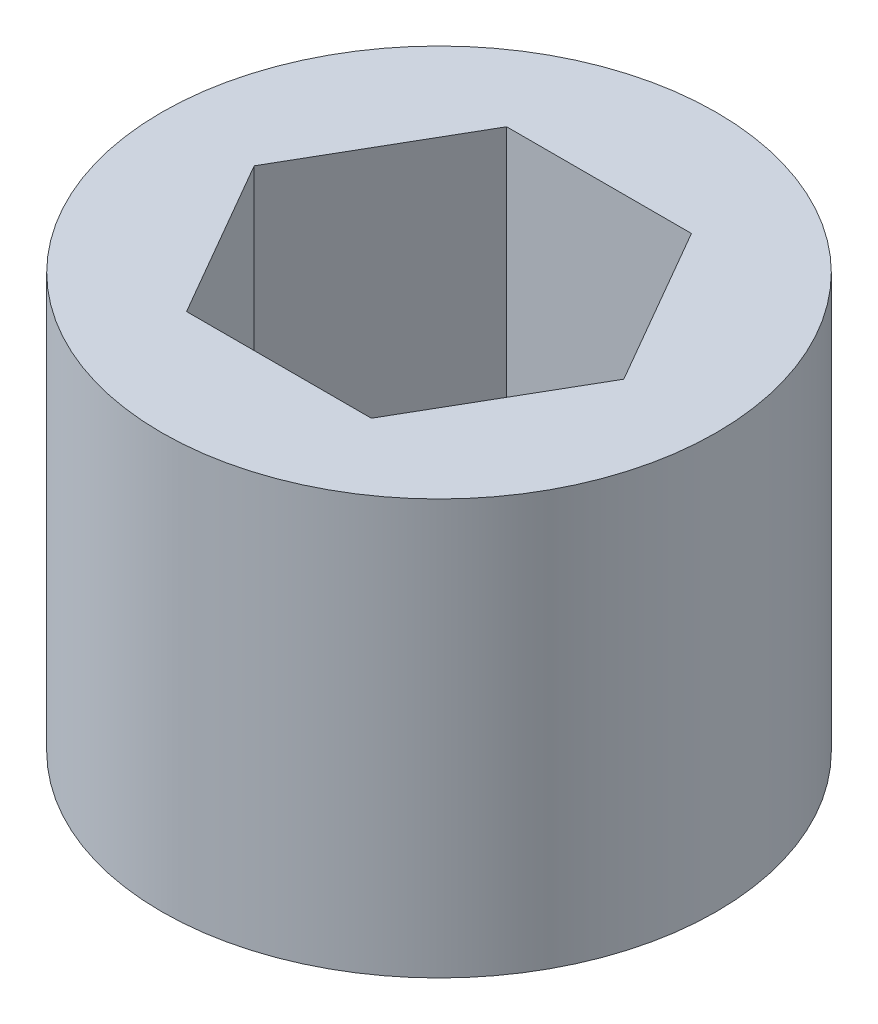
ISO-10303-21;
HEADER;
FILE_DESCRIPTION(('STEP AP214'),'2;1');
FILE_NAME('part.step','',(''),(''),'','','');
FILE_SCHEMA(('AUTOMOTIVE_DESIGN { 1 0 10303 214 1 1 1 1 }'));
ENDSEC;
DATA;
#1=APPLICATION_CONTEXT('core data for automotive mechanical design processes');
#2=APPLICATION_PROTOCOL_DEFINITION('international standard','automotive_design',2000,#1);
#3=PRODUCT_CONTEXT('',#1,'mechanical');
#4=PRODUCT('Part','Part','',(#3));
#5=PRODUCT_RELATED_PRODUCT_CATEGORY('part','',(#4));
#6=PRODUCT_DEFINITION_FORMATION('','',#4);
#7=PRODUCT_DEFINITION_CONTEXT('part definition',#1,'design');
#8=PRODUCT_DEFINITION('design','',#6,#7);
#9=PRODUCT_DEFINITION_SHAPE('','',#8);
#10=(LENGTH_UNIT() NAMED_UNIT(*) SI_UNIT(.MILLI.,.METRE.));
#11=(NAMED_UNIT(*) PLANE_ANGLE_UNIT() SI_UNIT($,.RADIAN.));
#12=(NAMED_UNIT(*) SI_UNIT($,.STERADIAN.) SOLID_ANGLE_UNIT());
#13=UNCERTAINTY_MEASURE_WITH_UNIT(LENGTH_MEASURE(1.E-05),#10,'distance_accuracy_value','');
#14=(GEOMETRIC_REPRESENTATION_CONTEXT(3) GLOBAL_UNCERTAINTY_ASSIGNED_CONTEXT((#13)) GLOBAL_UNIT_ASSIGNED_CONTEXT((#10,
#11,#12)) REPRESENTATION_CONTEXT('',''));
#15=CARTESIAN_POINT('',(0.,0.,0.));
#16=DIRECTION('',(0.,0.,1.));
#17=DIRECTION('',(1.,0.,0.));
#18=AXIS2_PLACEMENT_3D('',#15,#16,#17);
#19=CARTESIAN_POINT('',(0.,3.0861,0.));
#20=DIRECTION('',(0.,1.,0.));
#21=DIRECTION('',(0.,0.,1.));
#22=AXIS2_PLACEMENT_3D('',#19,#20,#21);
#23=PLANE('',#22);
#24=CARTESIAN_POINT('',(0.,3.0861,0.));
#25=DIRECTION('',(0.,1.,0.));
#26=DIRECTION('',(0.,0.,1.));
#27=AXIS2_PLACEMENT_3D('',#24,#25,#26);
#28=CIRCLE('',#27,4.1275);
#29=CARTESIAN_POINT('',(0.,3.0861,4.1275));
#30=VERTEX_POINT('',#29);
#31=EDGE_CURVE('E11',#30,#30,#28,.T.);
#32=ORIENTED_EDGE('',*,*,#31,.T.);
#33=EDGE_LOOP('',(#32));
#34=FACE_BOUND('',#33,.T.);
#35=DIRECTION('',(0.5,0.,-0.866025403784439));
#36=VECTOR('',#35,1.);
#37=CARTESIAN_POINT('',(1.3748153285078,3.0861,2.38125));
#38=LINE('',#37,#36);
#39=CARTESIAN_POINT('',(1.3748153285078,3.0861,2.38125));
#40=VERTEX_POINT('',#39);
#41=CARTESIAN_POINT('',(2.74963065701559,3.0861,0.));
#42=VERTEX_POINT('',#41);
#43=EDGE_CURVE('E102',#40,#42,#38,.T.);
#44=ORIENTED_EDGE('',*,*,#43,.F.);
#45=DIRECTION('',(1.,0.,0.));
#46=VECTOR('',#45,1.);
#47=CARTESIAN_POINT('',(-1.3748153285078,3.0861,2.38125));
#48=LINE('',#47,#46);
#49=CARTESIAN_POINT('',(-1.3748153285078,3.0861,2.38125));
#50=VERTEX_POINT('',#49);
#51=EDGE_CURVE('E93',#50,#40,#48,.T.);
#52=ORIENTED_EDGE('',*,*,#51,.F.);
#53=DIRECTION('',(0.5,0.,0.866025403784439));
#54=VECTOR('',#53,1.);
#55=CARTESIAN_POINT('',(-2.74963065701559,3.0861,0.));
#56=LINE('',#55,#54);
#57=CARTESIAN_POINT('',(-2.74963065701559,3.0861,0.));
#58=VERTEX_POINT('',#57);
#59=EDGE_CURVE('E127',#58,#50,#56,.T.);
#60=ORIENTED_EDGE('',*,*,#59,.F.);
#61=DIRECTION('',(-0.5,0.,0.866025403784439));
#62=VECTOR('',#61,1.);
#63=CARTESIAN_POINT('',(-1.3748153285078,3.0861,-2.38125));
#64=LINE('',#63,#62);
#65=CARTESIAN_POINT('',(-1.3748153285078,3.0861,-2.38125));
#66=VERTEX_POINT('',#65);
#67=EDGE_CURVE('E124',#66,#58,#64,.T.);
#68=ORIENTED_EDGE('',*,*,#67,.F.);
#69=DIRECTION('',(-1.,0.,0.));
#70=VECTOR('',#69,1.);
#71=CARTESIAN_POINT('',(1.3748153285078,3.0861,-2.38125));
#72=LINE('',#71,#70);
#73=CARTESIAN_POINT('',(1.3748153285078,3.0861,-2.38125));
#74=VERTEX_POINT('',#73);
#75=EDGE_CURVE('E119',#74,#66,#72,.T.);
#76=ORIENTED_EDGE('',*,*,#75,.F.);
#77=DIRECTION('',(-0.5,0.,-0.866025403784438));
#78=VECTOR('',#77,1.);
#79=CARTESIAN_POINT('',(2.74963065701559,3.0861,0.));
#80=LINE('',#79,#78);
#81=EDGE_CURVE('E115',#42,#74,#80,.T.);
#82=ORIENTED_EDGE('',*,*,#81,.F.);
#83=EDGE_LOOP('',(#44,#52,#60,#68,#76,#82));
#84=FACE_BOUND('',#83,.T.);
#85=ADVANCED_FACE('F39',(#34,#84),#23,.T.);
#86=CARTESIAN_POINT('',(0.,-3.0861,0.));
#87=DIRECTION('',(0.,1.,0.));
#88=DIRECTION('',(0.,0.,1.));
#89=AXIS2_PLACEMENT_3D('',#86,#87,#88);
#90=PLANE('',#89);
#91=CARTESIAN_POINT('',(0.,-3.0861,0.));
#92=DIRECTION('',(0.,1.,0.));
#93=DIRECTION('',(0.,0.,1.));
#94=AXIS2_PLACEMENT_3D('',#91,#92,#93);
#95=CIRCLE('',#94,4.1275);
#96=CARTESIAN_POINT('',(0.,-3.0861,4.1275));
#97=VERTEX_POINT('',#96);
#98=EDGE_CURVE('E43',#97,#97,#95,.T.);
#99=ORIENTED_EDGE('',*,*,#98,.F.);
#100=EDGE_LOOP('',(#99));
#101=FACE_BOUND('',#100,.T.);
#102=DIRECTION('',(1.,0.,0.));
#103=VECTOR('',#102,1.);
#104=CARTESIAN_POINT('',(-1.3748153285078,-3.0861,2.38125));
#105=LINE('',#104,#103);
#106=CARTESIAN_POINT('',(-1.3748153285078,-3.0861,2.38125));
#107=VERTEX_POINT('',#106);
#108=CARTESIAN_POINT('',(1.3748153285078,-3.0861,2.38125));
#109=VERTEX_POINT('',#108);
#110=EDGE_CURVE('E63',#107,#109,#105,.T.);
#111=ORIENTED_EDGE('',*,*,#110,.T.);
#112=DIRECTION('',(0.5,0.,-0.866025403784439));
#113=VECTOR('',#112,1.);
#114=CARTESIAN_POINT('',(1.3748153285078,-3.0861,2.38125));
#115=LINE('',#114,#113);
#116=CARTESIAN_POINT('',(2.74963065701559,-3.0861,0.));
#117=VERTEX_POINT('',#116);
#118=EDGE_CURVE('E109',#109,#117,#115,.T.);
#119=ORIENTED_EDGE('',*,*,#118,.T.);
#120=DIRECTION('',(-0.5,0.,-0.866025403784438));
#121=VECTOR('',#120,1.);
#122=CARTESIAN_POINT('',(2.74963065701559,-3.0861,0.));
#123=LINE('',#122,#121);
#124=CARTESIAN_POINT('',(1.3748153285078,-3.0861,-2.38125));
#125=VERTEX_POINT('',#124);
#126=EDGE_CURVE('E134',#117,#125,#123,.T.);
#127=ORIENTED_EDGE('',*,*,#126,.T.);
#128=DIRECTION('',(-1.,0.,0.));
#129=VECTOR('',#128,1.);
#130=CARTESIAN_POINT('',(1.3748153285078,-3.0861,-2.38125));
#131=LINE('',#130,#129);
#132=CARTESIAN_POINT('',(-1.3748153285078,-3.0861,-2.38125));
#133=VERTEX_POINT('',#132);
#134=EDGE_CURVE('E138',#125,#133,#131,.T.);
#135=ORIENTED_EDGE('',*,*,#134,.T.);
#136=DIRECTION('',(-0.5,0.,0.866025403784439));
#137=VECTOR('',#136,1.);
#138=CARTESIAN_POINT('',(-1.3748153285078,-3.0861,-2.38125));
#139=LINE('',#138,#137);
#140=CARTESIAN_POINT('',(-2.74963065701559,-3.0861,0.));
#141=VERTEX_POINT('',#140);
#142=EDGE_CURVE('E142',#133,#141,#139,.T.);
#143=ORIENTED_EDGE('',*,*,#142,.T.);
#144=DIRECTION('',(0.5,0.,0.866025403784439));
#145=VECTOR('',#144,1.);
#146=CARTESIAN_POINT('',(-2.74963065701559,-3.0861,0.));
#147=LINE('',#146,#145);
#148=EDGE_CURVE('E103',#141,#107,#147,.T.);
#149=ORIENTED_EDGE('',*,*,#148,.T.);
#150=EDGE_LOOP('',(#111,#119,#127,#135,#143,#149));
#151=FACE_BOUND('',#150,.T.);
#152=ADVANCED_FACE('F166',(#101,#151),#90,.F.);
#153=CARTESIAN_POINT('',(0.,3.0861,0.));
#154=DIRECTION('',(0.,-1.,0.));
#155=DIRECTION('',(0.,0.,-1.));
#156=AXIS2_PLACEMENT_3D('',#153,#154,#155);
#157=CYLINDRICAL_SURFACE('',#156,4.1275);
#158=ORIENTED_EDGE('',*,*,#31,.F.);
#159=EDGE_LOOP('',(#158));
#160=FACE_BOUND('',#159,.T.);
#161=ORIENTED_EDGE('',*,*,#98,.T.);
#162=EDGE_LOOP('',(#161));
#163=FACE_BOUND('',#162,.T.);
#164=ADVANCED_FACE('F41',(#160,#163),#157,.T.);
#165=CARTESIAN_POINT('',(-1.3748153285078,3.0861,2.38125));
#166=DIRECTION('',(0.,0.,-1.));
#167=DIRECTION('',(-1.,0.,0.));
#168=AXIS2_PLACEMENT_3D('',#165,#166,#167);
#169=PLANE('',#168);
#170=ORIENTED_EDGE('',*,*,#110,.F.);
#171=DIRECTION('',(0.,-1.,0.));
#172=VECTOR('',#171,1.);
#173=CARTESIAN_POINT('',(-1.3748153285078,3.0861,2.38125));
#174=LINE('',#173,#172);
#175=EDGE_CURVE('E97',#50,#107,#174,.T.);
#176=ORIENTED_EDGE('',*,*,#175,.F.);
#177=ORIENTED_EDGE('',*,*,#51,.T.);
#178=DIRECTION('',(0.,-1.,0.));
#179=VECTOR('',#178,1.);
#180=CARTESIAN_POINT('',(1.3748153285078,3.0861,2.38125));
#181=LINE('',#180,#179);
#182=EDGE_CURVE('E96',#40,#109,#181,.T.);
#183=ORIENTED_EDGE('',*,*,#182,.T.);
#184=EDGE_LOOP('',(#170,#176,#177,#183));
#185=FACE_BOUND('',#184,.T.);
#186=ADVANCED_FACE('F95',(#185),#169,.T.);
#187=CARTESIAN_POINT('',(1.3748153285078,3.0861,2.38125));
#188=DIRECTION('',(-0.866025403784439,0.,-0.5));
#189=DIRECTION('',(-0.5,0.,0.866025403784439));
#190=AXIS2_PLACEMENT_3D('',#187,#188,#189);
#191=PLANE('',#190);
#192=ORIENTED_EDGE('',*,*,#118,.F.);
#193=ORIENTED_EDGE('',*,*,#182,.F.);
#194=ORIENTED_EDGE('',*,*,#43,.T.);
#195=DIRECTION('',(0.,-1.,0.));
#196=VECTOR('',#195,1.);
#197=CARTESIAN_POINT('',(2.74963065701559,3.0861,0.));
#198=LINE('',#197,#196);
#199=EDGE_CURVE('E111',#42,#117,#198,.T.);
#200=ORIENTED_EDGE('',*,*,#199,.T.);
#201=EDGE_LOOP('',(#192,#193,#194,#200));
#202=FACE_BOUND('',#201,.T.);
#203=ADVANCED_FACE('F106',(#202),#191,.T.);
#204=CARTESIAN_POINT('',(2.74963065701559,3.0861,0.));
#205=DIRECTION('',(-0.866025403784438,0.,0.5));
#206=DIRECTION('',(0.5,0.,0.866025403784438));
#207=AXIS2_PLACEMENT_3D('',#204,#205,#206);
#208=PLANE('',#207);
#209=ORIENTED_EDGE('',*,*,#126,.F.);
#210=ORIENTED_EDGE('',*,*,#199,.F.);
#211=ORIENTED_EDGE('',*,*,#81,.T.);
#212=DIRECTION('',(0.,-1.,0.));
#213=VECTOR('',#212,1.);
#214=CARTESIAN_POINT('',(1.3748153285078,3.0861,-2.38125));
#215=LINE('',#214,#213);
#216=EDGE_CURVE('E156',#74,#125,#215,.T.);
#217=ORIENTED_EDGE('',*,*,#216,.T.);
#218=EDGE_LOOP('',(#209,#210,#211,#217));
#219=FACE_BOUND('',#218,.T.);
#220=ADVANCED_FACE('F162',(#219),#208,.T.);
#221=CARTESIAN_POINT('',(1.3748153285078,3.0861,-2.38125));
#222=DIRECTION('',(0.,0.,1.));
#223=DIRECTION('',(1.,0.,0.));
#224=AXIS2_PLACEMENT_3D('',#221,#222,#223);
#225=PLANE('',#224);
#226=ORIENTED_EDGE('',*,*,#134,.F.);
#227=ORIENTED_EDGE('',*,*,#216,.F.);
#228=ORIENTED_EDGE('',*,*,#75,.T.);
#229=DIRECTION('',(0.,-1.,0.));
#230=VECTOR('',#229,1.);
#231=CARTESIAN_POINT('',(-1.3748153285078,3.0861,-2.38125));
#232=LINE('',#231,#230);
#233=EDGE_CURVE('E153',#66,#133,#232,.T.);
#234=ORIENTED_EDGE('',*,*,#233,.T.);
#235=EDGE_LOOP('',(#226,#227,#228,#234));
#236=FACE_BOUND('',#235,.T.);
#237=ADVANCED_FACE('F174',(#236),#225,.T.);
#238=CARTESIAN_POINT('',(-1.3748153285078,3.0861,-2.38125));
#239=DIRECTION('',(0.866025403784439,0.,0.5));
#240=DIRECTION('',(0.5,0.,-0.866025403784439));
#241=AXIS2_PLACEMENT_3D('',#238,#239,#240);
#242=PLANE('',#241);
#243=ORIENTED_EDGE('',*,*,#142,.F.);
#244=ORIENTED_EDGE('',*,*,#233,.F.);
#245=ORIENTED_EDGE('',*,*,#67,.T.);
#246=DIRECTION('',(0.,-1.,0.));
#247=VECTOR('',#246,1.);
#248=CARTESIAN_POINT('',(-2.74963065701559,3.0861,0.));
#249=LINE('',#248,#247);
#250=EDGE_CURVE('E55',#58,#141,#249,.T.);
#251=ORIENTED_EDGE('',*,*,#250,.T.);
#252=EDGE_LOOP('',(#243,#244,#245,#251));
#253=FACE_BOUND('',#252,.T.);
#254=ADVANCED_FACE('F172',(#253),#242,.T.);
#255=CARTESIAN_POINT('',(-2.74963065701559,3.0861,0.));
#256=DIRECTION('',(0.866025403784439,0.,-0.5));
#257=DIRECTION('',(-0.5,0.,-0.866025403784439));
#258=AXIS2_PLACEMENT_3D('',#255,#256,#257);
#259=PLANE('',#258);
#260=ORIENTED_EDGE('',*,*,#148,.F.);
#261=ORIENTED_EDGE('',*,*,#250,.F.);
#262=ORIENTED_EDGE('',*,*,#59,.T.);
#263=ORIENTED_EDGE('',*,*,#175,.T.);
#264=EDGE_LOOP('',(#260,#261,#262,#263));
#265=FACE_BOUND('',#264,.T.);
#266=ADVANCED_FACE('F168',(#265),#259,.T.);
#267=CLOSED_SHELL('',(#85,#152,#164,#186,#203,#220,#237,#254,#266));
#268=MANIFOLD_SOLID_BREP('B2',#267);
#269=ADVANCED_BREP_SHAPE_REPRESENTATION('',(#18,#268),#14);
#270=SHAPE_DEFINITION_REPRESENTATION(#9,#269);
ENDSEC;
END-ISO-10303-21;
